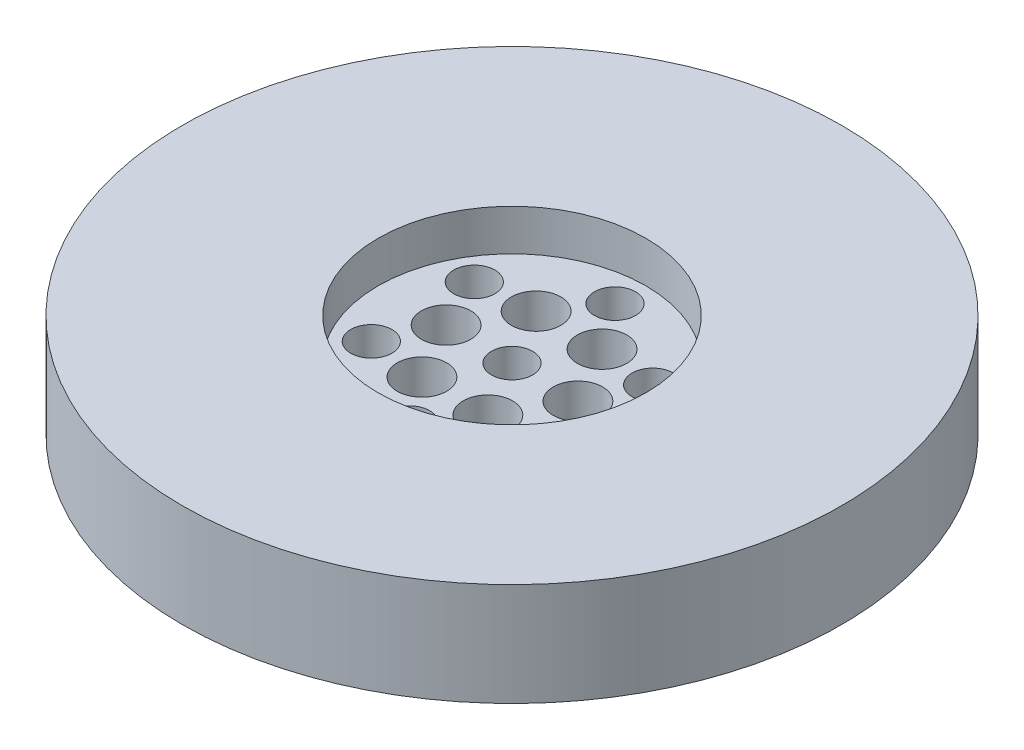
ISO-10303-21;
HEADER;
FILE_DESCRIPTION(('STEP AP214'),'2;1');
FILE_NAME('part.step','',(''),(''),'','','');
FILE_SCHEMA(('AUTOMOTIVE_DESIGN { 1 0 10303 214 1 1 1 1 }'));
ENDSEC;
DATA;
#1=APPLICATION_CONTEXT('core data for automotive mechanical design processes');
#2=APPLICATION_PROTOCOL_DEFINITION('international standard','automotive_design',2000,#1);
#3=PRODUCT_CONTEXT('',#1,'mechanical');
#4=PRODUCT('Part','Part','',(#3));
#5=PRODUCT_RELATED_PRODUCT_CATEGORY('part','',(#4));
#6=PRODUCT_DEFINITION_FORMATION('','',#4);
#7=PRODUCT_DEFINITION_CONTEXT('part definition',#1,'design');
#8=PRODUCT_DEFINITION('design','',#6,#7);
#9=PRODUCT_DEFINITION_SHAPE('','',#8);
#10=(LENGTH_UNIT() NAMED_UNIT(*) SI_UNIT(.MILLI.,.METRE.));
#11=(NAMED_UNIT(*) PLANE_ANGLE_UNIT() SI_UNIT($,.RADIAN.));
#12=(NAMED_UNIT(*) SI_UNIT($,.STERADIAN.) SOLID_ANGLE_UNIT());
#13=UNCERTAINTY_MEASURE_WITH_UNIT(LENGTH_MEASURE(1.E-05),#10,'distance_accuracy_value','');
#14=(GEOMETRIC_REPRESENTATION_CONTEXT(3) GLOBAL_UNCERTAINTY_ASSIGNED_CONTEXT((#13)) GLOBAL_UNIT_ASSIGNED_CONTEXT((#10,
#11,#12)) REPRESENTATION_CONTEXT('',''));
#15=CARTESIAN_POINT('',(0.,0.,0.));
#16=DIRECTION('',(0.,0.,1.));
#17=DIRECTION('',(1.,0.,0.));
#18=AXIS2_PLACEMENT_3D('',#15,#16,#17);
#19=CARTESIAN_POINT('',(0.,5.,0.));
#20=DIRECTION('',(0.,-1.,0.));
#21=DIRECTION('',(0.,0.,-1.));
#22=AXIS2_PLACEMENT_3D('',#19,#20,#21);
#23=CYLINDRICAL_SURFACE('',#22,16.);
#24=CARTESIAN_POINT('',(0.,5.,0.));
#25=DIRECTION('',(0.,1.,0.));
#26=DIRECTION('',(0.,0.,1.));
#27=AXIS2_PLACEMENT_3D('',#24,#25,#26);
#28=CIRCLE('',#27,16.);
#29=CARTESIAN_POINT('',(0.,5.,16.));
#30=VERTEX_POINT('',#29);
#31=EDGE_CURVE('E10',#30,#30,#28,.T.);
#32=ORIENTED_EDGE('',*,*,#31,.F.);
#33=EDGE_LOOP('',(#32));
#34=FACE_BOUND('',#33,.T.);
#35=CARTESIAN_POINT('',(0.,0.,0.));
#36=DIRECTION('',(0.,1.,0.));
#37=DIRECTION('',(0.,0.,1.));
#38=AXIS2_PLACEMENT_3D('',#35,#36,#37);
#39=CIRCLE('',#38,16.);
#40=CARTESIAN_POINT('',(0.,0.,16.));
#41=VERTEX_POINT('',#40);
#42=EDGE_CURVE('E34',#41,#41,#39,.T.);
#43=ORIENTED_EDGE('',*,*,#42,.T.);
#44=EDGE_LOOP('',(#43));
#45=FACE_BOUND('',#44,.T.);
#46=ADVANCED_FACE('F31',(#34,#45),#23,.T.);
#47=CARTESIAN_POINT('',(0.,5.,0.));
#48=DIRECTION('',(0.,1.,0.));
#49=DIRECTION('',(0.,0.,1.));
#50=AXIS2_PLACEMENT_3D('',#47,#48,#49);
#51=PLANE('',#50);
#52=CARTESIAN_POINT('',(0.,5.,0.));
#53=DIRECTION('',(0.,1.,0.));
#54=DIRECTION('',(0.,0.,1.));
#55=AXIS2_PLACEMENT_3D('',#52,#53,#54);
#56=CIRCLE('',#55,6.5);
#57=CARTESIAN_POINT('',(0.,5.,6.5));
#58=VERTEX_POINT('',#57);
#59=EDGE_CURVE('E43',#58,#58,#56,.T.);
#60=ORIENTED_EDGE('',*,*,#59,.F.);
#61=EDGE_LOOP('',(#60));
#62=FACE_BOUND('',#61,.T.);
#63=ORIENTED_EDGE('',*,*,#31,.T.);
#64=EDGE_LOOP('',(#63));
#65=FACE_BOUND('',#64,.T.);
#66=ADVANCED_FACE('F174',(#62,#65),#51,.T.);
#67=CARTESIAN_POINT('',(0.,0.,0.));
#68=DIRECTION('',(0.,1.,0.));
#69=DIRECTION('',(0.,0.,1.));
#70=AXIS2_PLACEMENT_3D('',#67,#68,#69);
#71=PLANE('',#70);
#72=CARTESIAN_POINT('',(-1.60000000000001,0.,-2.7712812921102));
#73=DIRECTION('',(0.,1.,0.));
#74=DIRECTION('',(0.866025403784436,0.,-0.500000000000004));
#75=AXIS2_PLACEMENT_3D('',#72,#73,#74);
#76=CIRCLE('',#75,1.2);
#77=CARTESIAN_POINT('',(-0.56076951545869,0.,-3.3712812921102));
#78=VERTEX_POINT('',#77);
#79=EDGE_CURVE('E100',#78,#78,#76,.T.);
#80=ORIENTED_EDGE('',*,*,#79,.T.);
#81=EDGE_LOOP('',(#80));
#82=FACE_BOUND('',#81,.T.);
#83=CARTESIAN_POINT('',(-3.2,0.,0.));
#84=DIRECTION('',(0.,1.,0.));
#85=DIRECTION('',(0.,0.,-1.));
#86=AXIS2_PLACEMENT_3D('',#83,#84,#85);
#87=CIRCLE('',#86,1.2);
#88=CARTESIAN_POINT('',(-3.2,0.,-1.2));
#89=VERTEX_POINT('',#88);
#90=EDGE_CURVE('E118',#89,#89,#87,.T.);
#91=ORIENTED_EDGE('',*,*,#90,.T.);
#92=EDGE_LOOP('',(#91));
#93=FACE_BOUND('',#92,.T.);
#94=CARTESIAN_POINT('',(-1.59999999999997,0.,2.77128129211022));
#95=DIRECTION('',(0.,1.,0.));
#96=DIRECTION('',(-0.866025403784443,0.,-0.499999999999992));
#97=AXIS2_PLACEMENT_3D('',#94,#95,#96);
#98=CIRCLE('',#97,1.2);
#99=CARTESIAN_POINT('',(-2.63923048454131,0.,2.17128129211023));
#100=VERTEX_POINT('',#99);
#101=EDGE_CURVE('E112',#100,#100,#98,.T.);
#102=ORIENTED_EDGE('',*,*,#101,.T.);
#103=EDGE_LOOP('',(#102));
#104=FACE_BOUND('',#103,.T.);
#105=CARTESIAN_POINT('',(1.60000000000003,0.,2.77128129211019));
#106=DIRECTION('',(0.,1.,0.));
#107=DIRECTION('',(-0.866025403784433,0.,0.50000000000001));
#108=AXIS2_PLACEMENT_3D('',#105,#106,#107);
#109=CIRCLE('',#108,1.2);
#110=CARTESIAN_POINT('',(0.560769515458714,0.,3.3712812921102));
#111=VERTEX_POINT('',#110);
#112=EDGE_CURVE('E106',#111,#111,#109,.T.);
#113=ORIENTED_EDGE('',*,*,#112,.T.);
#114=EDGE_LOOP('',(#113));
#115=FACE_BOUND('',#114,.T.);
#116=CARTESIAN_POINT('',(1.59999999999999,0.,-2.77128129211021));
#117=DIRECTION('',(0.,1.,0.));
#118=DIRECTION('',(0.86602540378444,0.,0.499999999999998));
#119=AXIS2_PLACEMENT_3D('',#116,#117,#118);
#120=CIRCLE('',#119,1.2);
#121=CARTESIAN_POINT('',(2.63923048454132,0.,-2.17128129211021));
#122=VERTEX_POINT('',#121);
#123=EDGE_CURVE('E77',#122,#122,#120,.T.);
#124=ORIENTED_EDGE('',*,*,#123,.T.);
#125=EDGE_LOOP('',(#124));
#126=FACE_BOUND('',#125,.T.);
#127=CARTESIAN_POINT('',(-4.33012701892218,0.,2.50000000000002));
#128=DIRECTION('',(0.,1.,0.));
#129=DIRECTION('',(0.866025403784436,0.,-0.500000000000004));
#130=AXIS2_PLACEMENT_3D('',#127,#128,#129);
#131=CIRCLE('',#130,1.);
#132=CARTESIAN_POINT('',(-3.46410161513775,0.,2.00000000000002));
#133=VERTEX_POINT('',#132);
#134=EDGE_CURVE('E70',#133,#133,#131,.T.);
#135=ORIENTED_EDGE('',*,*,#134,.T.);
#136=EDGE_LOOP('',(#135));
#137=FACE_BOUND('',#136,.T.);
#138=CARTESIAN_POINT('',(0.,0.,5.));
#139=DIRECTION('',(0.,1.,0.));
#140=DIRECTION('',(0.,0.,-1.));
#141=AXIS2_PLACEMENT_3D('',#138,#139,#140);
#142=CIRCLE('',#141,1.);
#143=CARTESIAN_POINT('',(0.,0.,4.));
#144=VERTEX_POINT('',#143);
#145=EDGE_CURVE('E89',#144,#144,#142,.T.);
#146=ORIENTED_EDGE('',*,*,#145,.T.);
#147=EDGE_LOOP('',(#146));
#148=FACE_BOUND('',#147,.T.);
#149=CARTESIAN_POINT('',(4.33012701892222,0.,2.49999999999996));
#150=DIRECTION('',(0.,1.,0.));
#151=DIRECTION('',(-0.866025403784443,0.,-0.499999999999992));
#152=AXIS2_PLACEMENT_3D('',#149,#150,#151);
#153=CIRCLE('',#152,1.);
#154=CARTESIAN_POINT('',(3.46410161513777,0.,1.99999999999997));
#155=VERTEX_POINT('',#154);
#156=EDGE_CURVE('E83',#155,#155,#153,.T.);
#157=ORIENTED_EDGE('',*,*,#156,.T.);
#158=EDGE_LOOP('',(#157));
#159=FACE_BOUND('',#158,.T.);
#160=CARTESIAN_POINT('',(4.33012701892216,0.,-2.50000000000005));
#161=DIRECTION('',(0.,1.,0.));
#162=DIRECTION('',(-0.866025403784433,0.,0.50000000000001));
#163=AXIS2_PLACEMENT_3D('',#160,#161,#162);
#164=CIRCLE('',#163,1.);
#165=CARTESIAN_POINT('',(3.46410161513773,0.,-2.00000000000004));
#166=VERTEX_POINT('',#165);
#167=EDGE_CURVE('E76',#166,#166,#164,.T.);
#168=ORIENTED_EDGE('',*,*,#167,.T.);
#169=EDGE_LOOP('',(#168));
#170=FACE_BOUND('',#169,.T.);
#171=CARTESIAN_POINT('',(-4.3301270189222,0.,-2.49999999999999));
#172=DIRECTION('',(0.,1.,0.));
#173=DIRECTION('',(0.86602540378444,0.,0.499999999999998));
#174=AXIS2_PLACEMENT_3D('',#171,#172,#173);
#175=CIRCLE('',#174,1.);
#176=CARTESIAN_POINT('',(-3.46410161513776,0.,-1.99999999999999));
#177=VERTEX_POINT('',#176);
#178=EDGE_CURVE('E64',#177,#177,#175,.T.);
#179=ORIENTED_EDGE('',*,*,#178,.T.);
#180=EDGE_LOOP('',(#179));
#181=FACE_BOUND('',#180,.T.);
#182=CARTESIAN_POINT('',(0.,0.,-5.));
#183=DIRECTION('',(0.,1.,0.));
#184=DIRECTION('',(0.,0.,1.));
#185=AXIS2_PLACEMENT_3D('',#182,#183,#184);
#186=CIRCLE('',#185,1.);
#187=CARTESIAN_POINT('',(0.,0.,-4.));
#188=VERTEX_POINT('',#187);
#189=EDGE_CURVE('E58',#188,#188,#186,.T.);
#190=ORIENTED_EDGE('',*,*,#189,.T.);
#191=EDGE_LOOP('',(#190));
#192=FACE_BOUND('',#191,.T.);
#193=CARTESIAN_POINT('',(3.2,0.,0.));
#194=DIRECTION('',(0.,1.,0.));
#195=DIRECTION('',(0.,0.,1.));
#196=AXIS2_PLACEMENT_3D('',#193,#194,#195);
#197=CIRCLE('',#196,1.2);
#198=CARTESIAN_POINT('',(3.2,0.,1.2));
#199=VERTEX_POINT('',#198);
#200=EDGE_CURVE('E52',#199,#199,#197,.T.);
#201=ORIENTED_EDGE('',*,*,#200,.T.);
#202=EDGE_LOOP('',(#201));
#203=FACE_BOUND('',#202,.T.);
#204=CARTESIAN_POINT('',(0.,0.,0.));
#205=DIRECTION('',(0.,1.,0.));
#206=DIRECTION('',(0.,0.,1.));
#207=AXIS2_PLACEMENT_3D('',#204,#205,#206);
#208=CIRCLE('',#207,1.);
#209=CARTESIAN_POINT('',(0.,0.,1.));
#210=VERTEX_POINT('',#209);
#211=EDGE_CURVE('E46',#210,#210,#208,.T.);
#212=ORIENTED_EDGE('',*,*,#211,.T.);
#213=EDGE_LOOP('',(#212));
#214=FACE_BOUND('',#213,.T.);
#215=ORIENTED_EDGE('',*,*,#42,.F.);
#216=EDGE_LOOP('',(#215));
#217=FACE_BOUND('',#216,.T.);
#218=ADVANCED_FACE('F127',(#82,#93,#104,#115,#126,#137,#148,#159,#170,#181,#192,#203,#214,#217),
#71,.F.);
#219=CARTESIAN_POINT('',(0.,3.,0.));
#220=DIRECTION('',(0.,1.,0.));
#221=DIRECTION('',(0.,0.,1.));
#222=AXIS2_PLACEMENT_3D('',#219,#220,#221);
#223=CYLINDRICAL_SURFACE('',#222,6.5);
#224=CARTESIAN_POINT('',(0.,3.,0.));
#225=DIRECTION('',(0.,1.,0.));
#226=DIRECTION('',(0.,0.,1.));
#227=AXIS2_PLACEMENT_3D('',#224,#225,#226);
#228=CIRCLE('',#227,6.5);
#229=CARTESIAN_POINT('',(0.,3.,6.5));
#230=VERTEX_POINT('',#229);
#231=EDGE_CURVE('E41',#230,#230,#228,.T.);
#232=ORIENTED_EDGE('',*,*,#231,.F.);
#233=EDGE_LOOP('',(#232));
#234=FACE_BOUND('',#233,.T.);
#235=ORIENTED_EDGE('',*,*,#59,.T.);
#236=EDGE_LOOP('',(#235));
#237=FACE_BOUND('',#236,.T.);
#238=ADVANCED_FACE('F141',(#234,#237),#223,.F.);
#239=CARTESIAN_POINT('',(0.,3.,0.));
#240=DIRECTION('',(0.,1.,0.));
#241=DIRECTION('',(0.,0.,1.));
#242=AXIS2_PLACEMENT_3D('',#239,#240,#241);
#243=PLANE('',#242);
#244=CARTESIAN_POINT('',(-1.60000000000001,3.,-2.7712812921102));
#245=DIRECTION('',(0.,1.,0.));
#246=DIRECTION('',(0.866025403784436,0.,-0.500000000000004));
#247=AXIS2_PLACEMENT_3D('',#244,#245,#246);
#248=CIRCLE('',#247,1.2);
#249=CARTESIAN_POINT('',(-0.56076951545869,3.,-3.3712812921102));
#250=VERTEX_POINT('',#249);
#251=EDGE_CURVE('E121',#250,#250,#248,.T.);
#252=ORIENTED_EDGE('',*,*,#251,.F.);
#253=EDGE_LOOP('',(#252));
#254=FACE_BOUND('',#253,.T.);
#255=CARTESIAN_POINT('',(-3.2,3.,0.));
#256=DIRECTION('',(0.,1.,0.));
#257=DIRECTION('',(0.,0.,-1.));
#258=AXIS2_PLACEMENT_3D('',#255,#256,#257);
#259=CIRCLE('',#258,1.2);
#260=CARTESIAN_POINT('',(-3.2,3.,-1.2));
#261=VERTEX_POINT('',#260);
#262=EDGE_CURVE('E115',#261,#261,#259,.T.);
#263=ORIENTED_EDGE('',*,*,#262,.F.);
#264=EDGE_LOOP('',(#263));
#265=FACE_BOUND('',#264,.T.);
#266=CARTESIAN_POINT('',(-1.59999999999997,3.,2.77128129211022));
#267=DIRECTION('',(0.,1.,0.));
#268=DIRECTION('',(-0.866025403784443,0.,-0.499999999999992));
#269=AXIS2_PLACEMENT_3D('',#266,#267,#268);
#270=CIRCLE('',#269,1.2);
#271=CARTESIAN_POINT('',(-2.63923048454131,3.,2.17128129211023));
#272=VERTEX_POINT('',#271);
#273=EDGE_CURVE('E109',#272,#272,#270,.T.);
#274=ORIENTED_EDGE('',*,*,#273,.F.);
#275=EDGE_LOOP('',(#274));
#276=FACE_BOUND('',#275,.T.);
#277=CARTESIAN_POINT('',(1.60000000000003,3.,2.77128129211019));
#278=DIRECTION('',(0.,1.,0.));
#279=DIRECTION('',(-0.866025403784433,0.,0.50000000000001));
#280=AXIS2_PLACEMENT_3D('',#277,#278,#279);
#281=CIRCLE('',#280,1.2);
#282=CARTESIAN_POINT('',(0.560769515458714,3.,3.3712812921102));
#283=VERTEX_POINT('',#282);
#284=EDGE_CURVE('E103',#283,#283,#281,.T.);
#285=ORIENTED_EDGE('',*,*,#284,.F.);
#286=EDGE_LOOP('',(#285));
#287=FACE_BOUND('',#286,.T.);
#288=CARTESIAN_POINT('',(1.59999999999999,3.,-2.77128129211021));
#289=DIRECTION('',(0.,1.,0.));
#290=DIRECTION('',(0.86602540378444,0.,0.499999999999998));
#291=AXIS2_PLACEMENT_3D('',#288,#289,#290);
#292=CIRCLE('',#291,1.2);
#293=CARTESIAN_POINT('',(2.63923048454132,3.,-2.17128129211021));
#294=VERTEX_POINT('',#293);
#295=EDGE_CURVE('E97',#294,#294,#292,.T.);
#296=ORIENTED_EDGE('',*,*,#295,.F.);
#297=EDGE_LOOP('',(#296));
#298=FACE_BOUND('',#297,.T.);
#299=CARTESIAN_POINT('',(-4.33012701892218,3.,2.50000000000002));
#300=DIRECTION('',(0.,1.,0.));
#301=DIRECTION('',(0.866025403784436,0.,-0.500000000000004));
#302=AXIS2_PLACEMENT_3D('',#299,#300,#301);
#303=CIRCLE('',#302,1.);
#304=CARTESIAN_POINT('',(-3.46410161513775,3.,2.00000000000002));
#305=VERTEX_POINT('',#304);
#306=EDGE_CURVE('E92',#305,#305,#303,.T.);
#307=ORIENTED_EDGE('',*,*,#306,.F.);
#308=EDGE_LOOP('',(#307));
#309=FACE_BOUND('',#308,.T.);
#310=CARTESIAN_POINT('',(0.,3.,5.));
#311=DIRECTION('',(0.,1.,0.));
#312=DIRECTION('',(0.,0.,-1.));
#313=AXIS2_PLACEMENT_3D('',#310,#311,#312);
#314=CIRCLE('',#313,1.);
#315=CARTESIAN_POINT('',(0.,3.,4.));
#316=VERTEX_POINT('',#315);
#317=EDGE_CURVE('E86',#316,#316,#314,.T.);
#318=ORIENTED_EDGE('',*,*,#317,.F.);
#319=EDGE_LOOP('',(#318));
#320=FACE_BOUND('',#319,.T.);
#321=CARTESIAN_POINT('',(4.33012701892222,3.,2.49999999999996));
#322=DIRECTION('',(0.,1.,0.));
#323=DIRECTION('',(-0.866025403784443,0.,-0.499999999999992));
#324=AXIS2_PLACEMENT_3D('',#321,#322,#323);
#325=CIRCLE('',#324,1.);
#326=CARTESIAN_POINT('',(3.46410161513777,3.,1.99999999999997));
#327=VERTEX_POINT('',#326);
#328=EDGE_CURVE('E80',#327,#327,#325,.T.);
#329=ORIENTED_EDGE('',*,*,#328,.F.);
#330=EDGE_LOOP('',(#329));
#331=FACE_BOUND('',#330,.T.);
#332=CARTESIAN_POINT('',(4.33012701892216,3.,-2.50000000000005));
#333=DIRECTION('',(0.,1.,0.));
#334=DIRECTION('',(-0.866025403784433,0.,0.50000000000001));
#335=AXIS2_PLACEMENT_3D('',#332,#333,#334);
#336=CIRCLE('',#335,1.);
#337=CARTESIAN_POINT('',(3.46410161513773,3.,-2.00000000000004));
#338=VERTEX_POINT('',#337);
#339=EDGE_CURVE('E73',#338,#338,#336,.T.);
#340=ORIENTED_EDGE('',*,*,#339,.F.);
#341=EDGE_LOOP('',(#340));
#342=FACE_BOUND('',#341,.T.);
#343=CARTESIAN_POINT('',(-4.3301270189222,3.,-2.49999999999999));
#344=DIRECTION('',(0.,1.,0.));
#345=DIRECTION('',(0.86602540378444,0.,0.499999999999998));
#346=AXIS2_PLACEMENT_3D('',#343,#344,#345);
#347=CIRCLE('',#346,1.);
#348=CARTESIAN_POINT('',(-3.46410161513776,3.,-1.99999999999999));
#349=VERTEX_POINT('',#348);
#350=EDGE_CURVE('E67',#349,#349,#347,.T.);
#351=ORIENTED_EDGE('',*,*,#350,.F.);
#352=EDGE_LOOP('',(#351));
#353=FACE_BOUND('',#352,.T.);
#354=CARTESIAN_POINT('',(0.,3.,-5.));
#355=DIRECTION('',(0.,1.,0.));
#356=DIRECTION('',(0.,0.,1.));
#357=AXIS2_PLACEMENT_3D('',#354,#355,#356);
#358=CIRCLE('',#357,1.);
#359=CARTESIAN_POINT('',(0.,3.,-4.));
#360=VERTEX_POINT('',#359);
#361=EDGE_CURVE('E61',#360,#360,#358,.T.);
#362=ORIENTED_EDGE('',*,*,#361,.F.);
#363=EDGE_LOOP('',(#362));
#364=FACE_BOUND('',#363,.T.);
#365=CARTESIAN_POINT('',(3.2,3.,0.));
#366=DIRECTION('',(0.,1.,0.));
#367=DIRECTION('',(0.,0.,1.));
#368=AXIS2_PLACEMENT_3D('',#365,#366,#367);
#369=CIRCLE('',#368,1.2);
#370=CARTESIAN_POINT('',(3.2,3.,1.2));
#371=VERTEX_POINT('',#370);
#372=EDGE_CURVE('E55',#371,#371,#369,.T.);
#373=ORIENTED_EDGE('',*,*,#372,.F.);
#374=EDGE_LOOP('',(#373));
#375=FACE_BOUND('',#374,.T.);
#376=CARTESIAN_POINT('',(0.,3.,0.));
#377=DIRECTION('',(0.,1.,0.));
#378=DIRECTION('',(0.,0.,1.));
#379=AXIS2_PLACEMENT_3D('',#376,#377,#378);
#380=CIRCLE('',#379,1.);
#381=CARTESIAN_POINT('',(0.,3.,1.));
#382=VERTEX_POINT('',#381);
#383=EDGE_CURVE('E49',#382,#382,#380,.T.);
#384=ORIENTED_EDGE('',*,*,#383,.F.);
#385=EDGE_LOOP('',(#384));
#386=FACE_BOUND('',#385,.T.);
#387=ORIENTED_EDGE('',*,*,#231,.T.);
#388=EDGE_LOOP('',(#387));
#389=FACE_BOUND('',#388,.T.);
#390=ADVANCED_FACE('F137',(#254,#265,#276,#287,#298,#309,#320,#331,#342,#353,#364,#375,#386,
#389),#243,.T.);
#391=CARTESIAN_POINT('',(0.,0.,0.));
#392=DIRECTION('',(0.,1.,0.));
#393=DIRECTION('',(0.,0.,1.));
#394=AXIS2_PLACEMENT_3D('',#391,#392,#393);
#395=CYLINDRICAL_SURFACE('',#394,1.);
#396=ORIENTED_EDGE('',*,*,#211,.F.);
#397=EDGE_LOOP('',(#396));
#398=FACE_BOUND('',#397,.T.);
#399=ORIENTED_EDGE('',*,*,#383,.T.);
#400=EDGE_LOOP('',(#399));
#401=FACE_BOUND('',#400,.T.);
#402=ADVANCED_FACE('F140',(#398,#401),#395,.F.);
#403=CARTESIAN_POINT('',(3.2,0.,0.));
#404=DIRECTION('',(0.,1.,0.));
#405=DIRECTION('',(0.,0.,1.));
#406=AXIS2_PLACEMENT_3D('',#403,#404,#405);
#407=CYLINDRICAL_SURFACE('',#406,1.2);
#408=ORIENTED_EDGE('',*,*,#200,.F.);
#409=EDGE_LOOP('',(#408));
#410=FACE_BOUND('',#409,.T.);
#411=ORIENTED_EDGE('',*,*,#372,.T.);
#412=EDGE_LOOP('',(#411));
#413=FACE_BOUND('',#412,.T.);
#414=ADVANCED_FACE('F185',(#410,#413),#407,.F.);
#415=CARTESIAN_POINT('',(0.,0.,-5.));
#416=DIRECTION('',(0.,1.,0.));
#417=DIRECTION('',(0.,0.,1.));
#418=AXIS2_PLACEMENT_3D('',#415,#416,#417);
#419=CYLINDRICAL_SURFACE('',#418,1.);
#420=ORIENTED_EDGE('',*,*,#189,.F.);
#421=EDGE_LOOP('',(#420));
#422=FACE_BOUND('',#421,.T.);
#423=ORIENTED_EDGE('',*,*,#361,.T.);
#424=EDGE_LOOP('',(#423));
#425=FACE_BOUND('',#424,.T.);
#426=ADVANCED_FACE('F189',(#422,#425),#419,.F.);
#427=CARTESIAN_POINT('',(-4.3301270189222,0.,-2.49999999999999));
#428=DIRECTION('',(0.,1.,0.));
#429=DIRECTION('',(0.,0.,1.));
#430=AXIS2_PLACEMENT_3D('',#427,#428,#429);
#431=CYLINDRICAL_SURFACE('',#430,1.);
#432=ORIENTED_EDGE('',*,*,#178,.F.);
#433=EDGE_LOOP('',(#432));
#434=FACE_BOUND('',#433,.T.);
#435=ORIENTED_EDGE('',*,*,#350,.T.);
#436=EDGE_LOOP('',(#435));
#437=FACE_BOUND('',#436,.T.);
#438=ADVANCED_FACE('F193',(#434,#437),#431,.F.);
#439=CARTESIAN_POINT('',(4.33012701892216,0.,-2.50000000000005));
#440=DIRECTION('',(0.,1.,0.));
#441=DIRECTION('',(0.,0.,1.));
#442=AXIS2_PLACEMENT_3D('',#439,#440,#441);
#443=CYLINDRICAL_SURFACE('',#442,1.);
#444=ORIENTED_EDGE('',*,*,#167,.F.);
#445=EDGE_LOOP('',(#444));
#446=FACE_BOUND('',#445,.T.);
#447=ORIENTED_EDGE('',*,*,#339,.T.);
#448=EDGE_LOOP('',(#447));
#449=FACE_BOUND('',#448,.T.);
#450=ADVANCED_FACE('F197',(#446,#449),#443,.F.);
#451=CARTESIAN_POINT('',(4.33012701892222,0.,2.49999999999996));
#452=DIRECTION('',(0.,1.,0.));
#453=DIRECTION('',(0.,0.,1.));
#454=AXIS2_PLACEMENT_3D('',#451,#452,#453);
#455=CYLINDRICAL_SURFACE('',#454,1.);
#456=ORIENTED_EDGE('',*,*,#156,.F.);
#457=EDGE_LOOP('',(#456));
#458=FACE_BOUND('',#457,.T.);
#459=ORIENTED_EDGE('',*,*,#328,.T.);
#460=EDGE_LOOP('',(#459));
#461=FACE_BOUND('',#460,.T.);
#462=ADVANCED_FACE('F201',(#458,#461),#455,.F.);
#463=CARTESIAN_POINT('',(0.,0.,5.));
#464=DIRECTION('',(0.,1.,0.));
#465=DIRECTION('',(0.,0.,1.));
#466=AXIS2_PLACEMENT_3D('',#463,#464,#465);
#467=CYLINDRICAL_SURFACE('',#466,1.);
#468=ORIENTED_EDGE('',*,*,#145,.F.);
#469=EDGE_LOOP('',(#468));
#470=FACE_BOUND('',#469,.T.);
#471=ORIENTED_EDGE('',*,*,#317,.T.);
#472=EDGE_LOOP('',(#471));
#473=FACE_BOUND('',#472,.T.);
#474=ADVANCED_FACE('F205',(#470,#473),#467,.F.);
#475=CARTESIAN_POINT('',(-4.33012701892218,0.,2.50000000000002));
#476=DIRECTION('',(0.,1.,0.));
#477=DIRECTION('',(0.,0.,1.));
#478=AXIS2_PLACEMENT_3D('',#475,#476,#477);
#479=CYLINDRICAL_SURFACE('',#478,1.);
#480=ORIENTED_EDGE('',*,*,#134,.F.);
#481=EDGE_LOOP('',(#480));
#482=FACE_BOUND('',#481,.T.);
#483=ORIENTED_EDGE('',*,*,#306,.T.);
#484=EDGE_LOOP('',(#483));
#485=FACE_BOUND('',#484,.T.);
#486=ADVANCED_FACE('F209',(#482,#485),#479,.F.);
#487=CARTESIAN_POINT('',(1.59999999999999,0.,-2.77128129211021));
#488=DIRECTION('',(0.,1.,0.));
#489=DIRECTION('',(0.,0.,1.));
#490=AXIS2_PLACEMENT_3D('',#487,#488,#489);
#491=CYLINDRICAL_SURFACE('',#490,1.2);
#492=ORIENTED_EDGE('',*,*,#123,.F.);
#493=EDGE_LOOP('',(#492));
#494=FACE_BOUND('',#493,.T.);
#495=ORIENTED_EDGE('',*,*,#295,.T.);
#496=EDGE_LOOP('',(#495));
#497=FACE_BOUND('',#496,.T.);
#498=ADVANCED_FACE('F213',(#494,#497),#491,.F.);
#499=CARTESIAN_POINT('',(1.60000000000003,0.,2.77128129211019));
#500=DIRECTION('',(0.,1.,0.));
#501=DIRECTION('',(0.,0.,1.));
#502=AXIS2_PLACEMENT_3D('',#499,#500,#501);
#503=CYLINDRICAL_SURFACE('',#502,1.2);
#504=ORIENTED_EDGE('',*,*,#112,.F.);
#505=EDGE_LOOP('',(#504));
#506=FACE_BOUND('',#505,.T.);
#507=ORIENTED_EDGE('',*,*,#284,.T.);
#508=EDGE_LOOP('',(#507));
#509=FACE_BOUND('',#508,.T.);
#510=ADVANCED_FACE('F217',(#506,#509),#503,.F.);
#511=CARTESIAN_POINT('',(-1.59999999999997,0.,2.77128129211022));
#512=DIRECTION('',(0.,1.,0.));
#513=DIRECTION('',(0.,0.,1.));
#514=AXIS2_PLACEMENT_3D('',#511,#512,#513);
#515=CYLINDRICAL_SURFACE('',#514,1.2);
#516=ORIENTED_EDGE('',*,*,#101,.F.);
#517=EDGE_LOOP('',(#516));
#518=FACE_BOUND('',#517,.T.);
#519=ORIENTED_EDGE('',*,*,#273,.T.);
#520=EDGE_LOOP('',(#519));
#521=FACE_BOUND('',#520,.T.);
#522=ADVANCED_FACE('F221',(#518,#521),#515,.F.);
#523=CARTESIAN_POINT('',(-3.2,0.,0.));
#524=DIRECTION('',(0.,1.,0.));
#525=DIRECTION('',(0.,0.,1.));
#526=AXIS2_PLACEMENT_3D('',#523,#524,#525);
#527=CYLINDRICAL_SURFACE('',#526,1.2);
#528=ORIENTED_EDGE('',*,*,#90,.F.);
#529=EDGE_LOOP('',(#528));
#530=FACE_BOUND('',#529,.T.);
#531=ORIENTED_EDGE('',*,*,#262,.T.);
#532=EDGE_LOOP('',(#531));
#533=FACE_BOUND('',#532,.T.);
#534=ADVANCED_FACE('F133',(#530,#533),#527,.F.);
#535=CARTESIAN_POINT('',(-1.60000000000001,0.,-2.7712812921102));
#536=DIRECTION('',(0.,1.,0.));
#537=DIRECTION('',(0.,0.,1.));
#538=AXIS2_PLACEMENT_3D('',#535,#536,#537);
#539=CYLINDRICAL_SURFACE('',#538,1.2);
#540=ORIENTED_EDGE('',*,*,#79,.F.);
#541=EDGE_LOOP('',(#540));
#542=FACE_BOUND('',#541,.T.);
#543=ORIENTED_EDGE('',*,*,#251,.T.);
#544=EDGE_LOOP('',(#543));
#545=FACE_BOUND('',#544,.T.);
#546=ADVANCED_FACE('F130',(#542,#545),#539,.F.);
#547=CLOSED_SHELL('',(#46,#66,#218,#238,#390,#402,#414,#426,#438,#450,#462,#474,#486,#498,#510,
#522,#534,#546));
#548=MANIFOLD_SOLID_BREP('B2',#547);
#549=ADVANCED_BREP_SHAPE_REPRESENTATION('',(#18,#548),#14);
#550=SHAPE_DEFINITION_REPRESENTATION(#9,#549);
ENDSEC;
END-ISO-10303-21;
